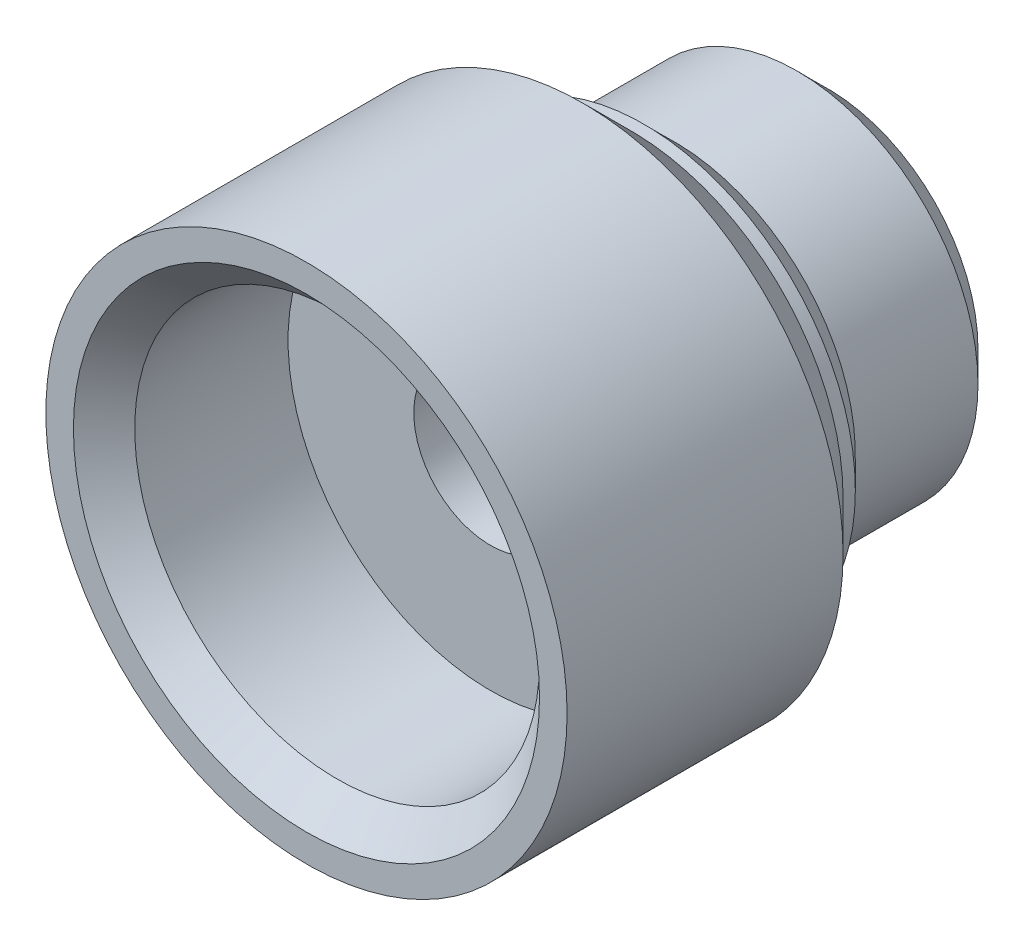
ISO-10303-21;
HEADER;
FILE_DESCRIPTION(('STEP AP214'),'2;1');
FILE_NAME('part.step','',(''),(''),'','','');
FILE_SCHEMA(('AUTOMOTIVE_DESIGN { 1 0 10303 214 1 1 1 1 }'));
ENDSEC;
DATA;
#1=APPLICATION_CONTEXT('core data for automotive mechanical design processes');
#2=APPLICATION_PROTOCOL_DEFINITION('international standard','automotive_design',2000,#1);
#3=PRODUCT_CONTEXT('',#1,'mechanical');
#4=PRODUCT('Part','Part','',(#3));
#5=PRODUCT_RELATED_PRODUCT_CATEGORY('part','',(#4));
#6=PRODUCT_DEFINITION_FORMATION('','',#4);
#7=PRODUCT_DEFINITION_CONTEXT('part definition',#1,'design');
#8=PRODUCT_DEFINITION('design','',#6,#7);
#9=PRODUCT_DEFINITION_SHAPE('','',#8);
#10=(LENGTH_UNIT() NAMED_UNIT(*) SI_UNIT(.MILLI.,.METRE.));
#11=(NAMED_UNIT(*) PLANE_ANGLE_UNIT() SI_UNIT($,.RADIAN.));
#12=(NAMED_UNIT(*) SI_UNIT($,.STERADIAN.) SOLID_ANGLE_UNIT());
#13=UNCERTAINTY_MEASURE_WITH_UNIT(LENGTH_MEASURE(1.E-05),#10,'distance_accuracy_value','');
#14=(GEOMETRIC_REPRESENTATION_CONTEXT(3) GLOBAL_UNCERTAINTY_ASSIGNED_CONTEXT((#13)) GLOBAL_UNIT_ASSIGNED_CONTEXT((#10,
#11,#12)) REPRESENTATION_CONTEXT('',''));
#15=CARTESIAN_POINT('',(0.,0.,0.));
#16=DIRECTION('',(0.,0.,1.));
#17=DIRECTION('',(1.,0.,0.));
#18=AXIS2_PLACEMENT_3D('',#15,#16,#17);
#19=CARTESIAN_POINT('',(0.,0.,3.));
#20=DIRECTION('',(0.,0.,-1.));
#21=DIRECTION('',(-1.,0.,0.));
#22=AXIS2_PLACEMENT_3D('',#19,#20,#21);
#23=CYLINDRICAL_SURFACE('',#22,1.25);
#24=CARTESIAN_POINT('',(0.,0.,0.5));
#25=DIRECTION('',(0.,0.,1.));
#26=DIRECTION('',(1.,0.,0.));
#27=AXIS2_PLACEMENT_3D('',#24,#25,#26);
#28=CIRCLE('',#27,1.25);
#29=CARTESIAN_POINT('',(1.25,0.,0.5));
#30=VERTEX_POINT('',#29);
#31=EDGE_CURVE('E42',#30,#30,#28,.F.);
#32=ORIENTED_EDGE('',*,*,#31,.T.);
#33=EDGE_LOOP('',(#32));
#34=FACE_BOUND('',#33,.T.);
#35=CARTESIAN_POINT('',(0.,0.,5.5));
#36=DIRECTION('',(0.,0.,1.));
#37=DIRECTION('',(1.,0.,0.));
#38=AXIS2_PLACEMENT_3D('',#35,#36,#37);
#39=CIRCLE('',#38,1.25);
#40=CARTESIAN_POINT('',(1.25,0.,5.5));
#41=VERTEX_POINT('',#40);
#42=EDGE_CURVE('E75',#41,#41,#39,.T.);
#43=ORIENTED_EDGE('',*,*,#42,.T.);
#44=EDGE_LOOP('',(#43));
#45=FACE_BOUND('',#44,.T.);
#46=ADVANCED_FACE('F34',(#34,#45),#23,.F.);
#47=CARTESIAN_POINT('',(0.,0.,0.));
#48=DIRECTION('',(0.,0.,1.));
#49=DIRECTION('',(1.,0.,0.));
#50=AXIS2_PLACEMENT_3D('',#47,#48,#49);
#51=PLANE('',#50);
#52=CARTESIAN_POINT('',(0.,0.,0.));
#53=DIRECTION('',(0.,0.,1.));
#54=DIRECTION('',(1.,0.,0.));
#55=AXIS2_PLACEMENT_3D('',#52,#53,#54);
#56=CIRCLE('',#55,1.75);
#57=CARTESIAN_POINT('',(1.75,0.,0.));
#58=VERTEX_POINT('',#57);
#59=EDGE_CURVE('E46',#58,#58,#56,.T.);
#60=ORIENTED_EDGE('',*,*,#59,.T.);
#61=EDGE_LOOP('',(#60));
#62=FACE_BOUND('',#61,.T.);
#63=CARTESIAN_POINT('',(0.,0.,0.));
#64=DIRECTION('',(0.,0.,1.));
#65=DIRECTION('',(1.,0.,0.));
#66=AXIS2_PLACEMENT_3D('',#63,#64,#65);
#67=CIRCLE('',#66,2.45);
#68=CARTESIAN_POINT('',(2.45,0.,0.));
#69=VERTEX_POINT('',#68);
#70=EDGE_CURVE('E58',#69,#69,#67,.F.);
#71=ORIENTED_EDGE('',*,*,#70,.T.);
#72=EDGE_LOOP('',(#71));
#73=FACE_BOUND('',#72,.T.);
#74=ADVANCED_FACE('F102',(#62,#73),#51,.F.);
#75=CARTESIAN_POINT('',(0.,0.,3.));
#76=DIRECTION('',(0.,0.,-1.));
#77=DIRECTION('',(-1.,0.,0.));
#78=AXIS2_PLACEMENT_3D('',#75,#76,#77);
#79=CYLINDRICAL_SURFACE('',#78,2.95);
#80=CARTESIAN_POINT('',(0.,0.,2.5));
#81=DIRECTION('',(0.,0.,-1.));
#82=DIRECTION('',(-1.,0.,0.));
#83=AXIS2_PLACEMENT_3D('',#80,#81,#82);
#84=CIRCLE('',#83,2.95);
#85=CARTESIAN_POINT('',(-2.95,0.,2.5));
#86=VERTEX_POINT('',#85);
#87=EDGE_CURVE('E59',#86,#86,#84,.T.);
#88=ORIENTED_EDGE('',*,*,#87,.T.);
#89=EDGE_LOOP('',(#88));
#90=FACE_BOUND('',#89,.T.);
#91=CARTESIAN_POINT('',(0.,0.,0.500000000000001));
#92=DIRECTION('',(0.,0.,1.));
#93=DIRECTION('',(1.,0.,0.));
#94=AXIS2_PLACEMENT_3D('',#91,#92,#93);
#95=CIRCLE('',#94,2.95);
#96=CARTESIAN_POINT('',(2.95,0.,0.500000000000001));
#97=VERTEX_POINT('',#96);
#98=EDGE_CURVE('E65',#97,#97,#95,.T.);
#99=ORIENTED_EDGE('',*,*,#98,.T.);
#100=EDGE_LOOP('',(#99));
#101=FACE_BOUND('',#100,.T.);
#102=ADVANCED_FACE('F107',(#90,#101),#79,.T.);
#103=CARTESIAN_POINT('',(0.,0.,8.5));
#104=DIRECTION('',(0.,0.,1.));
#105=DIRECTION('',(1.,0.,0.));
#106=AXIS2_PLACEMENT_3D('',#103,#104,#105);
#107=PLANE('',#106);
#108=CARTESIAN_POINT('',(0.,0.,8.5));
#109=DIRECTION('',(0.,0.,1.));
#110=DIRECTION('',(1.,0.,0.));
#111=AXIS2_PLACEMENT_3D('',#108,#109,#110);
#112=CIRCLE('',#111,3.8);
#113=CARTESIAN_POINT('',(3.8,0.,8.5));
#114=VERTEX_POINT('',#113);
#115=EDGE_CURVE('E68',#114,#114,#112,.F.);
#116=ORIENTED_EDGE('',*,*,#115,.T.);
#117=EDGE_LOOP('',(#116));
#118=FACE_BOUND('',#117,.T.);
#119=CARTESIAN_POINT('',(0.,0.,8.5));
#120=DIRECTION('',(0.,0.,1.));
#121=DIRECTION('',(1.,0.,0.));
#122=AXIS2_PLACEMENT_3D('',#119,#120,#121);
#123=CIRCLE('',#122,4.25);
#124=CARTESIAN_POINT('',(4.25,0.,8.5));
#125=VERTEX_POINT('',#124);
#126=EDGE_CURVE('E74',#125,#125,#123,.T.);
#127=ORIENTED_EDGE('',*,*,#126,.T.);
#128=EDGE_LOOP('',(#127));
#129=FACE_BOUND('',#128,.T.);
#130=ADVANCED_FACE('F97',(#118,#129),#107,.T.);
#131=CARTESIAN_POINT('',(0.,0.,8.5));
#132=DIRECTION('',(0.,0.,-1.));
#133=DIRECTION('',(-1.,0.,0.));
#134=AXIS2_PLACEMENT_3D('',#131,#132,#133);
#135=CYLINDRICAL_SURFACE('',#134,4.25);
#136=CARTESIAN_POINT('',(0.,0.,4.00000000000002));
#137=DIRECTION('',(0.,0.,1.));
#138=DIRECTION('',(1.,0.,0.));
#139=AXIS2_PLACEMENT_3D('',#136,#137,#138);
#140=CIRCLE('',#139,4.25);
#141=CARTESIAN_POINT('',(4.25,0.,4.00000000000002));
#142=VERTEX_POINT('',#141);
#143=EDGE_CURVE('E55',#142,#142,#140,.T.);
#144=ORIENTED_EDGE('',*,*,#143,.T.);
#145=EDGE_LOOP('',(#144));
#146=FACE_BOUND('',#145,.T.);
#147=ORIENTED_EDGE('',*,*,#126,.F.);
#148=EDGE_LOOP('',(#147));
#149=FACE_BOUND('',#148,.T.);
#150=ADVANCED_FACE('F87',(#146,#149),#135,.T.);
#151=CARTESIAN_POINT('',(0.,0.,5.5));
#152=DIRECTION('',(0.,0.,1.));
#153=DIRECTION('',(1.,0.,0.));
#154=AXIS2_PLACEMENT_3D('',#151,#152,#153);
#155=CYLINDRICAL_SURFACE('',#154,3.3);
#156=CARTESIAN_POINT('',(0.,0.,8.));
#157=DIRECTION('',(0.,0.,1.));
#158=DIRECTION('',(1.,0.,0.));
#159=AXIS2_PLACEMENT_3D('',#156,#157,#158);
#160=CIRCLE('',#159,3.3);
#161=CARTESIAN_POINT('',(3.3,0.,8.));
#162=VERTEX_POINT('',#161);
#163=EDGE_CURVE('E71',#162,#162,#160,.T.);
#164=ORIENTED_EDGE('',*,*,#163,.T.);
#165=EDGE_LOOP('',(#164));
#166=FACE_BOUND('',#165,.T.);
#167=CARTESIAN_POINT('',(0.,0.,5.5));
#168=DIRECTION('',(0.,0.,1.));
#169=DIRECTION('',(1.,0.,0.));
#170=AXIS2_PLACEMENT_3D('',#167,#168,#169);
#171=CIRCLE('',#170,3.3);
#172=CARTESIAN_POINT('',(3.3,0.,5.5));
#173=VERTEX_POINT('',#172);
#174=EDGE_CURVE('E62',#173,#173,#171,.T.);
#175=ORIENTED_EDGE('',*,*,#174,.F.);
#176=EDGE_LOOP('',(#175));
#177=FACE_BOUND('',#176,.T.);
#178=ADVANCED_FACE('F85',(#166,#177),#155,.F.);
#179=CARTESIAN_POINT('',(0.,0.,5.5));
#180=DIRECTION('',(0.,0.,1.));
#181=DIRECTION('',(1.,0.,0.));
#182=AXIS2_PLACEMENT_3D('',#179,#180,#181);
#183=PLANE('',#182);
#184=ORIENTED_EDGE('',*,*,#42,.F.);
#185=EDGE_LOOP('',(#184));
#186=FACE_BOUND('',#185,.T.);
#187=ORIENTED_EDGE('',*,*,#174,.T.);
#188=EDGE_LOOP('',(#187));
#189=FACE_BOUND('',#188,.T.);
#190=ADVANCED_FACE('F83',(#186,#189),#183,.T.);
#191=CARTESIAN_POINT('',(0.,0.,8.));
#192=DIRECTION('',(0.,0.,1.));
#193=DIRECTION('',(1.,0.,0.));
#194=AXIS2_PLACEMENT_3D('',#191,#192,#193);
#195=CONICAL_SURFACE('',#194,3.3,0.785398163397449);
#196=ORIENTED_EDGE('',*,*,#115,.F.);
#197=EDGE_LOOP('',(#196));
#198=FACE_BOUND('',#197,.T.);
#199=ORIENTED_EDGE('',*,*,#163,.F.);
#200=EDGE_LOOP('',(#199));
#201=FACE_BOUND('',#200,.T.);
#202=ADVANCED_FACE('F94',(#198,#201),#195,.F.);
#203=CARTESIAN_POINT('',(0.,0.,0.500000000000001));
#204=DIRECTION('',(0.,0.,1.));
#205=DIRECTION('',(1.,0.,0.));
#206=AXIS2_PLACEMENT_3D('',#203,#204,#205);
#207=CONICAL_SURFACE('',#206,2.95,0.78539816339745);
#208=ORIENTED_EDGE('',*,*,#70,.F.);
#209=EDGE_LOOP('',(#208));
#210=FACE_BOUND('',#209,.T.);
#211=ORIENTED_EDGE('',*,*,#98,.F.);
#212=EDGE_LOOP('',(#211));
#213=FACE_BOUND('',#212,.T.);
#214=ADVANCED_FACE('F121',(#210,#213),#207,.T.);
#215=CARTESIAN_POINT('',(0.,0.,2.5));
#216=DIRECTION('',(0.,0.,1.));
#217=DIRECTION('',(1.,0.,0.));
#218=AXIS2_PLACEMENT_3D('',#215,#216,#217);
#219=CYLINDRICAL_SURFACE('',#218,3.45);
#220=CARTESIAN_POINT('',(0.,0.,3.));
#221=DIRECTION('',(0.,0.,-1.));
#222=DIRECTION('',(-1.,0.,0.));
#223=AXIS2_PLACEMENT_3D('',#220,#221,#222);
#224=CIRCLE('',#223,3.45);
#225=CARTESIAN_POINT('',(-3.45,0.,3.));
#226=VERTEX_POINT('',#225);
#227=EDGE_CURVE('E10',#226,#226,#224,.F.);
#228=ORIENTED_EDGE('',*,*,#227,.T.);
#229=EDGE_LOOP('',(#228));
#230=FACE_BOUND('',#229,.T.);
#231=CARTESIAN_POINT('',(0.,0.,3.20000000000001));
#232=DIRECTION('',(0.,0.,1.));
#233=DIRECTION('',(1.,0.,0.));
#234=AXIS2_PLACEMENT_3D('',#231,#232,#233);
#235=CIRCLE('',#234,3.45);
#236=CARTESIAN_POINT('',(3.45,0.,3.20000000000001));
#237=VERTEX_POINT('',#236);
#238=EDGE_CURVE('E50',#237,#237,#235,.F.);
#239=ORIENTED_EDGE('',*,*,#238,.T.);
#240=EDGE_LOOP('',(#239));
#241=FACE_BOUND('',#240,.T.);
#242=ADVANCED_FACE('F128',(#230,#241),#219,.T.);
#243=CARTESIAN_POINT('',(0.,0.,4.00000000000002));
#244=DIRECTION('',(0.,0.,1.));
#245=DIRECTION('',(1.,0.,0.));
#246=AXIS2_PLACEMENT_3D('',#243,#244,#245);
#247=CONICAL_SURFACE('',#246,4.25,0.785398163397443);
#248=ORIENTED_EDGE('',*,*,#238,.F.);
#249=EDGE_LOOP('',(#248));
#250=FACE_BOUND('',#249,.T.);
#251=ORIENTED_EDGE('',*,*,#143,.F.);
#252=EDGE_LOOP('',(#251));
#253=FACE_BOUND('',#252,.T.);
#254=ADVANCED_FACE('F130',(#250,#253),#247,.T.);
#255=CARTESIAN_POINT('',(0.,0.,0.));
#256=DIRECTION('',(0.,0.,-1.));
#257=DIRECTION('',(-1.,0.,0.));
#258=AXIS2_PLACEMENT_3D('',#255,#256,#257);
#259=CONICAL_SURFACE('',#258,1.75,0.785398163397446);
#260=ORIENTED_EDGE('',*,*,#31,.F.);
#261=EDGE_LOOP('',(#260));
#262=FACE_BOUND('',#261,.T.);
#263=ORIENTED_EDGE('',*,*,#59,.F.);
#264=EDGE_LOOP('',(#263));
#265=FACE_BOUND('',#264,.T.);
#266=ADVANCED_FACE('F135',(#262,#265),#259,.F.);
#267=CARTESIAN_POINT('',(0.,0.,2.5));
#268=DIRECTION('',(0.,0.,1.));
#269=DIRECTION('',(1.,0.,0.));
#270=AXIS2_PLACEMENT_3D('',#267,#268,#269);
#271=CONICAL_SURFACE('',#270,2.95,0.785398163397447);
#272=ORIENTED_EDGE('',*,*,#227,.F.);
#273=EDGE_LOOP('',(#272));
#274=FACE_BOUND('',#273,.T.);
#275=ORIENTED_EDGE('',*,*,#87,.F.);
#276=EDGE_LOOP('',(#275));
#277=FACE_BOUND('',#276,.T.);
#278=ADVANCED_FACE('F37',(#274,#277),#271,.T.);
#279=CLOSED_SHELL('',(#46,#74,#102,#130,#150,#178,#190,#202,#214,#242,#254,#266,#278));
#280=MANIFOLD_SOLID_BREP('B2',#279);
#281=ADVANCED_BREP_SHAPE_REPRESENTATION('',(#18,#280),#14);
#282=SHAPE_DEFINITION_REPRESENTATION(#9,#281);
ENDSEC;
END-ISO-10303-21;
